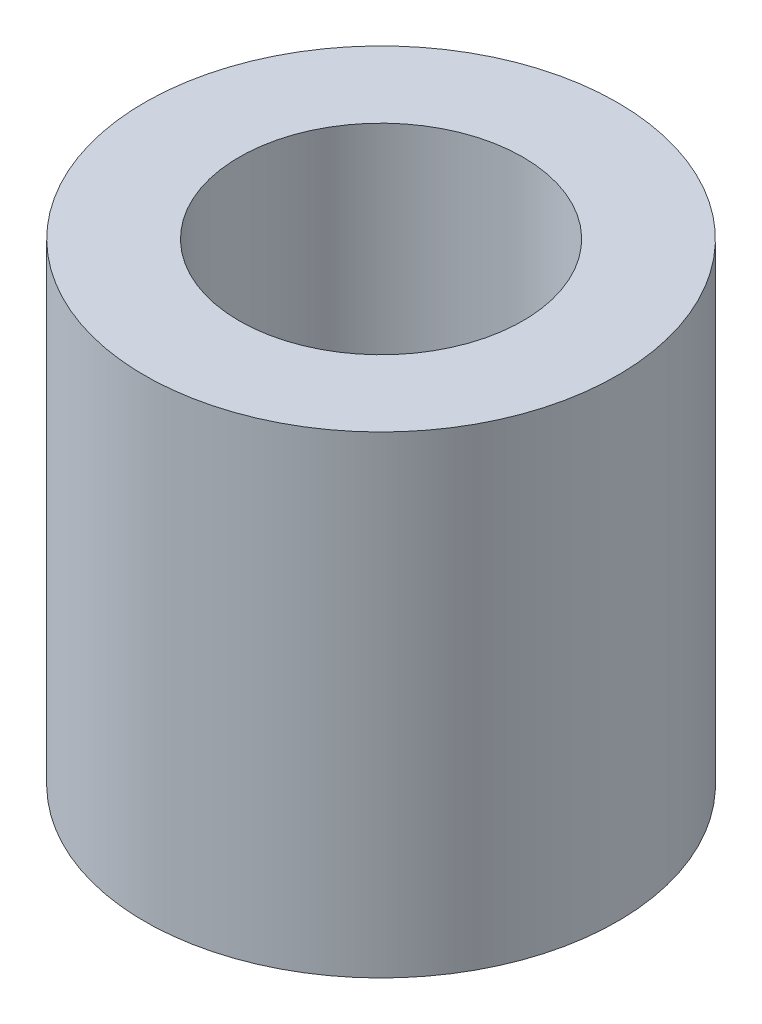
ISO-10303-21;
HEADER;
FILE_DESCRIPTION(('STEP AP214'),'2;1');
FILE_NAME('part.step','',(''),(''),'','','');
FILE_SCHEMA(('AUTOMOTIVE_DESIGN { 1 0 10303 214 1 1 1 1 }'));
ENDSEC;
DATA;
#1=APPLICATION_CONTEXT('core data for automotive mechanical design processes');
#2=APPLICATION_PROTOCOL_DEFINITION('international standard','automotive_design',2000,#1);
#3=PRODUCT_CONTEXT('',#1,'mechanical');
#4=PRODUCT('Part','Part','',(#3));
#5=PRODUCT_RELATED_PRODUCT_CATEGORY('part','',(#4));
#6=PRODUCT_DEFINITION_FORMATION('','',#4);
#7=PRODUCT_DEFINITION_CONTEXT('part definition',#1,'design');
#8=PRODUCT_DEFINITION('design','',#6,#7);
#9=PRODUCT_DEFINITION_SHAPE('','',#8);
#10=(LENGTH_UNIT() NAMED_UNIT(*) SI_UNIT(.MILLI.,.METRE.));
#11=(NAMED_UNIT(*) PLANE_ANGLE_UNIT() SI_UNIT($,.RADIAN.));
#12=(NAMED_UNIT(*) SI_UNIT($,.STERADIAN.) SOLID_ANGLE_UNIT());
#13=UNCERTAINTY_MEASURE_WITH_UNIT(LENGTH_MEASURE(1.E-05),#10,'distance_accuracy_value','');
#14=(GEOMETRIC_REPRESENTATION_CONTEXT(3) GLOBAL_UNCERTAINTY_ASSIGNED_CONTEXT((#13)) GLOBAL_UNIT_ASSIGNED_CONTEXT((#10,
#11,#12)) REPRESENTATION_CONTEXT('',''));
#15=CARTESIAN_POINT('',(0.,0.,0.));
#16=DIRECTION('',(0.,0.,1.));
#17=DIRECTION('',(1.,0.,0.));
#18=AXIS2_PLACEMENT_3D('',#15,#16,#17);
#19=CARTESIAN_POINT('',(0.,0.,0.));
#20=DIRECTION('',(0.,-1.,0.));
#21=DIRECTION('',(0.,0.,-1.));
#22=AXIS2_PLACEMENT_3D('',#19,#20,#21);
#23=CYLINDRICAL_SURFACE('',#22,1.5);
#24=CARTESIAN_POINT('',(0.,0.,0.));
#25=DIRECTION('',(0.,-1.,0.));
#26=DIRECTION('',(0.,0.,-1.));
#27=AXIS2_PLACEMENT_3D('',#24,#25,#26);
#28=CIRCLE('',#27,1.5);
#29=CARTESIAN_POINT('',(0.,0.,-1.5));
#30=VERTEX_POINT('',#29);
#31=EDGE_CURVE('E58',#30,#30,#28,.T.);
#32=ORIENTED_EDGE('',*,*,#31,.T.);
#33=EDGE_LOOP('',(#32));
#34=FACE_BOUND('',#33,.T.);
#35=CARTESIAN_POINT('',(0.,5.,0.));
#36=DIRECTION('',(0.,-1.,0.));
#37=DIRECTION('',(0.,0.,-1.));
#38=AXIS2_PLACEMENT_3D('',#35,#36,#37);
#39=CIRCLE('',#38,1.5);
#40=CARTESIAN_POINT('',(0.,5.,-1.5));
#41=VERTEX_POINT('',#40);
#42=EDGE_CURVE('E10',#41,#41,#39,.T.);
#43=ORIENTED_EDGE('',*,*,#42,.F.);
#44=EDGE_LOOP('',(#43));
#45=FACE_BOUND('',#44,.T.);
#46=ADVANCED_FACE('F41',(#34,#45),#23,.F.);
#47=CARTESIAN_POINT('',(1.5,5.,0.));
#48=DIRECTION('',(0.,1.,0.));
#49=DIRECTION('',(0.,0.,1.));
#50=AXIS2_PLACEMENT_3D('',#47,#48,#49);
#51=PLANE('',#50);
#52=ORIENTED_EDGE('',*,*,#42,.T.);
#53=EDGE_LOOP('',(#52));
#54=FACE_BOUND('',#53,.T.);
#55=CARTESIAN_POINT('',(0.,5.,0.));
#56=DIRECTION('',(0.,-1.,0.));
#57=DIRECTION('',(0.,0.,-1.));
#58=AXIS2_PLACEMENT_3D('',#55,#56,#57);
#59=CIRCLE('',#58,2.5);
#60=CARTESIAN_POINT('',(0.,5.,-2.5));
#61=VERTEX_POINT('',#60);
#62=EDGE_CURVE('E48',#61,#61,#59,.T.);
#63=ORIENTED_EDGE('',*,*,#62,.F.);
#64=EDGE_LOOP('',(#63));
#65=FACE_BOUND('',#64,.T.);
#66=ADVANCED_FACE('F75',(#54,#65),#51,.T.);
#67=CARTESIAN_POINT('',(0.,0.,0.));
#68=DIRECTION('',(0.,-1.,0.));
#69=DIRECTION('',(0.,0.,-1.));
#70=AXIS2_PLACEMENT_3D('',#67,#68,#69);
#71=CYLINDRICAL_SURFACE('',#70,2.5);
#72=ORIENTED_EDGE('',*,*,#62,.T.);
#73=EDGE_LOOP('',(#72));
#74=FACE_BOUND('',#73,.T.);
#75=CARTESIAN_POINT('',(0.,0.,0.));
#76=DIRECTION('',(0.,-1.,0.));
#77=DIRECTION('',(0.,0.,-1.));
#78=AXIS2_PLACEMENT_3D('',#75,#76,#77);
#79=CIRCLE('',#78,2.5);
#80=CARTESIAN_POINT('',(0.,0.,-2.5));
#81=VERTEX_POINT('',#80);
#82=EDGE_CURVE('E53',#81,#81,#79,.T.);
#83=ORIENTED_EDGE('',*,*,#82,.F.);
#84=EDGE_LOOP('',(#83));
#85=FACE_BOUND('',#84,.T.);
#86=ADVANCED_FACE('F69',(#74,#85),#71,.T.);
#87=CARTESIAN_POINT('',(1.5,0.,0.));
#88=DIRECTION('',(0.,-1.,0.));
#89=DIRECTION('',(0.,0.,-1.));
#90=AXIS2_PLACEMENT_3D('',#87,#88,#89);
#91=PLANE('',#90);
#92=ORIENTED_EDGE('',*,*,#82,.T.);
#93=EDGE_LOOP('',(#92));
#94=FACE_BOUND('',#93,.T.);
#95=ORIENTED_EDGE('',*,*,#31,.F.);
#96=EDGE_LOOP('',(#95));
#97=FACE_BOUND('',#96,.T.);
#98=ADVANCED_FACE('F67',(#94,#97),#91,.T.);
#99=CLOSED_SHELL('',(#46,#66,#86,#98));
#100=MANIFOLD_SOLID_BREP('B2',#99);
#101=ADVANCED_BREP_SHAPE_REPRESENTATION('',(#18,#100),#14);
#102=SHAPE_DEFINITION_REPRESENTATION(#9,#101);
ENDSEC;
END-ISO-10303-21;
